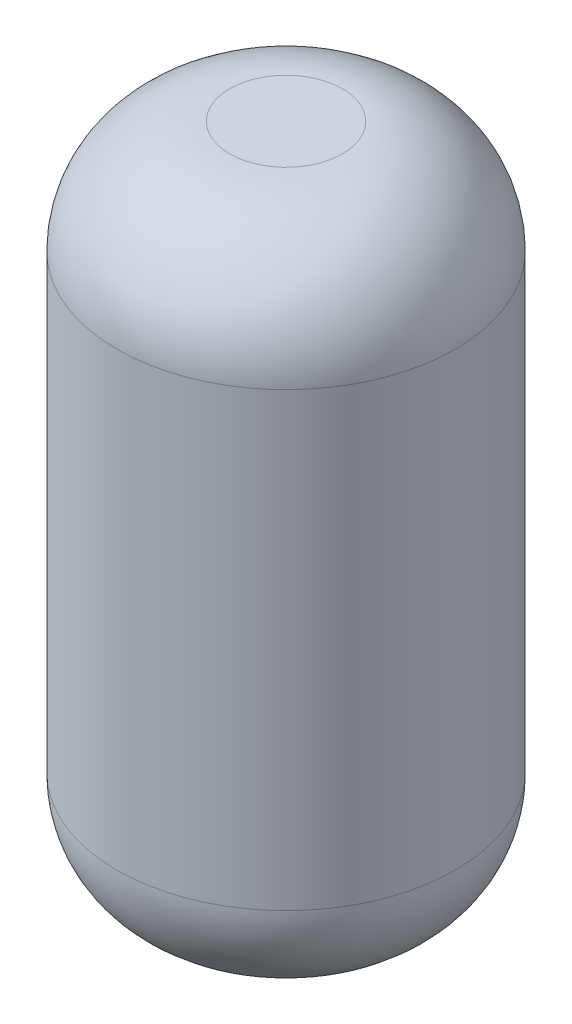
ISO-10303-21;
HEADER;
FILE_DESCRIPTION(('STEP AP214'),'2;1');
FILE_NAME('part.step','',(''),(''),'','','');
FILE_SCHEMA(('AUTOMOTIVE_DESIGN { 1 0 10303 214 1 1 1 1 }'));
ENDSEC;
DATA;
#1=APPLICATION_CONTEXT('core data for automotive mechanical design processes');
#2=APPLICATION_PROTOCOL_DEFINITION('international standard','automotive_design',2000,#1);
#3=PRODUCT_CONTEXT('',#1,'mechanical');
#4=PRODUCT('Part','Part','',(#3));
#5=PRODUCT_RELATED_PRODUCT_CATEGORY('part','',(#4));
#6=PRODUCT_DEFINITION_FORMATION('','',#4);
#7=PRODUCT_DEFINITION_CONTEXT('part definition',#1,'design');
#8=PRODUCT_DEFINITION('design','',#6,#7);
#9=PRODUCT_DEFINITION_SHAPE('','',#8);
#10=(LENGTH_UNIT() NAMED_UNIT(*) SI_UNIT(.MILLI.,.METRE.));
#11=(NAMED_UNIT(*) PLANE_ANGLE_UNIT() SI_UNIT($,.RADIAN.));
#12=(NAMED_UNIT(*) SI_UNIT($,.STERADIAN.) SOLID_ANGLE_UNIT());
#13=UNCERTAINTY_MEASURE_WITH_UNIT(LENGTH_MEASURE(1.E-05),#10,'distance_accuracy_value','');
#14=(GEOMETRIC_REPRESENTATION_CONTEXT(3) GLOBAL_UNCERTAINTY_ASSIGNED_CONTEXT((#13)) GLOBAL_UNIT_ASSIGNED_CONTEXT((#10,
#11,#12)) REPRESENTATION_CONTEXT('',''));
#15=CARTESIAN_POINT('',(0.,0.,0.));
#16=DIRECTION('',(0.,0.,1.));
#17=DIRECTION('',(1.,0.,0.));
#18=AXIS2_PLACEMENT_3D('',#15,#16,#17);
#19=CARTESIAN_POINT('',(0.,38.1,0.));
#20=DIRECTION('',(0.,-1.,0.));
#21=DIRECTION('',(0.,0.,-1.));
#22=AXIS2_PLACEMENT_3D('',#19,#20,#21);
#23=CYLINDRICAL_SURFACE('',#22,9.525);
#24=CARTESIAN_POINT('',(0.,31.75,0.));
#25=DIRECTION('',(0.,1.,0.));
#26=DIRECTION('',(0.,0.,1.));
#27=AXIS2_PLACEMENT_3D('',#24,#25,#26);
#28=CIRCLE('',#27,9.525);
#29=CARTESIAN_POINT('',(0.,31.75,9.525));
#30=VERTEX_POINT('',#29);
#31=EDGE_CURVE('E41',#30,#30,#28,.F.);
#32=ORIENTED_EDGE('',*,*,#31,.T.);
#33=EDGE_LOOP('',(#32));
#34=FACE_BOUND('',#33,.T.);
#35=CARTESIAN_POINT('',(0.,6.34999999999997,0.));
#36=DIRECTION('',(0.,1.,0.));
#37=DIRECTION('',(0.,0.,1.));
#38=AXIS2_PLACEMENT_3D('',#35,#36,#37);
#39=CIRCLE('',#38,9.525);
#40=CARTESIAN_POINT('',(0.,6.34999999999997,9.525));
#41=VERTEX_POINT('',#40);
#42=EDGE_CURVE('E45',#41,#41,#39,.T.);
#43=ORIENTED_EDGE('',*,*,#42,.T.);
#44=EDGE_LOOP('',(#43));
#45=FACE_BOUND('',#44,.T.);
#46=ADVANCED_FACE('F34',(#34,#45),#23,.T.);
#47=CARTESIAN_POINT('',(0.,38.1,0.));
#48=DIRECTION('',(0.,1.,0.));
#49=DIRECTION('',(0.,0.,1.));
#50=AXIS2_PLACEMENT_3D('',#47,#48,#49);
#51=PLANE('',#50);
#52=CARTESIAN_POINT('',(0.,38.1,0.));
#53=DIRECTION('',(0.,1.,0.));
#54=DIRECTION('',(0.,0.,1.));
#55=AXIS2_PLACEMENT_3D('',#52,#53,#54);
#56=CIRCLE('',#55,3.175);
#57=CARTESIAN_POINT('',(0.,38.1,3.175));
#58=VERTEX_POINT('',#57);
#59=EDGE_CURVE('E49',#58,#58,#56,.T.);
#60=ORIENTED_EDGE('',*,*,#59,.T.);
#61=EDGE_LOOP('',(#60));
#62=FACE_BOUND('',#61,.T.);
#63=ADVANCED_FACE('F55',(#62),#51,.T.);
#64=CARTESIAN_POINT('',(0.,0.,0.));
#65=DIRECTION('',(0.,1.,0.));
#66=DIRECTION('',(0.,0.,1.));
#67=AXIS2_PLACEMENT_3D('',#64,#65,#66);
#68=PLANE('',#67);
#69=CARTESIAN_POINT('',(0.,0.,0.));
#70=DIRECTION('',(0.,1.,0.));
#71=DIRECTION('',(0.,0.,1.));
#72=AXIS2_PLACEMENT_3D('',#69,#70,#71);
#73=CIRCLE('',#72,3.175);
#74=CARTESIAN_POINT('',(0.,0.,3.175));
#75=VERTEX_POINT('',#74);
#76=EDGE_CURVE('E10',#75,#75,#73,.F.);
#77=ORIENTED_EDGE('',*,*,#76,.T.);
#78=EDGE_LOOP('',(#77));
#79=FACE_BOUND('',#78,.T.);
#80=ADVANCED_FACE('F59',(#79),#68,.F.);
#81=CARTESIAN_POINT('',(0.,31.75,0.));
#82=DIRECTION('',(0.,1.,0.));
#83=DIRECTION('',(0.,0.,1.));
#84=AXIS2_PLACEMENT_3D('',#81,#82,#83);
#85=DEGENERATE_TOROIDAL_SURFACE('',#84,3.175,6.35,.T.);
#86=ORIENTED_EDGE('',*,*,#31,.F.);
#87=EDGE_LOOP('',(#86));
#88=FACE_BOUND('',#87,.T.);
#89=ORIENTED_EDGE('',*,*,#59,.F.);
#90=EDGE_LOOP('',(#89));
#91=FACE_BOUND('',#90,.T.);
#92=ADVANCED_FACE('F57',(#88,#91),#85,.T.);
#93=CARTESIAN_POINT('',(0.,6.35,0.));
#94=DIRECTION('',(0.,1.,0.));
#95=DIRECTION('',(0.,0.,1.));
#96=AXIS2_PLACEMENT_3D('',#93,#94,#95);
#97=DEGENERATE_TOROIDAL_SURFACE('',#96,3.175,6.35,.T.);
#98=ORIENTED_EDGE('',*,*,#76,.F.);
#99=EDGE_LOOP('',(#98));
#100=FACE_BOUND('',#99,.T.);
#101=ORIENTED_EDGE('',*,*,#42,.F.);
#102=EDGE_LOOP('',(#101));
#103=FACE_BOUND('',#102,.T.);
#104=ADVANCED_FACE('F36',(#100,#103),#97,.T.);
#105=CLOSED_SHELL('',(#46,#63,#80,#92,#104));
#106=MANIFOLD_SOLID_BREP('B2',#105);
#107=ADVANCED_BREP_SHAPE_REPRESENTATION('',(#18,#106),#14);
#108=SHAPE_DEFINITION_REPRESENTATION(#9,#107);
ENDSEC;
END-ISO-10303-21;
